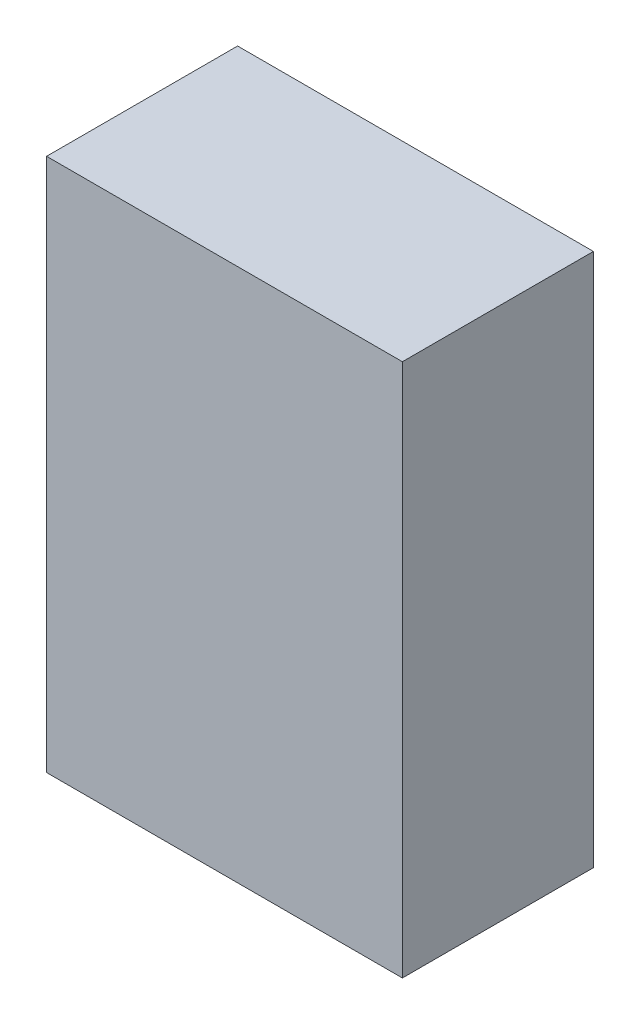
ISO-10303-21;
HEADER;
FILE_DESCRIPTION(('STEP AP214'),'2;1');
FILE_NAME('part.step','',(''),(''),'','','');
FILE_SCHEMA(('AUTOMOTIVE_DESIGN { 1 0 10303 214 1 1 1 1 }'));
ENDSEC;
DATA;
#1=APPLICATION_CONTEXT('core data for automotive mechanical design processes');
#2=APPLICATION_PROTOCOL_DEFINITION('international standard','automotive_design',2000,#1);
#3=PRODUCT_CONTEXT('',#1,'mechanical');
#4=PRODUCT('Part','Part','',(#3));
#5=PRODUCT_RELATED_PRODUCT_CATEGORY('part','',(#4));
#6=PRODUCT_DEFINITION_FORMATION('','',#4);
#7=PRODUCT_DEFINITION_CONTEXT('part definition',#1,'design');
#8=PRODUCT_DEFINITION('design','',#6,#7);
#9=PRODUCT_DEFINITION_SHAPE('','',#8);
#10=(LENGTH_UNIT() NAMED_UNIT(*) SI_UNIT(.MILLI.,.METRE.));
#11=(NAMED_UNIT(*) PLANE_ANGLE_UNIT() SI_UNIT($,.RADIAN.));
#12=(NAMED_UNIT(*) SI_UNIT($,.STERADIAN.) SOLID_ANGLE_UNIT());
#13=UNCERTAINTY_MEASURE_WITH_UNIT(LENGTH_MEASURE(1.E-05),#10,'distance_accuracy_value','');
#14=(GEOMETRIC_REPRESENTATION_CONTEXT(3) GLOBAL_UNCERTAINTY_ASSIGNED_CONTEXT((#13)) GLOBAL_UNIT_ASSIGNED_CONTEXT((#10,
#11,#12)) REPRESENTATION_CONTEXT('',''));
#15=CARTESIAN_POINT('',(0.,0.,0.));
#16=DIRECTION('',(0.,0.,1.));
#17=DIRECTION('',(1.,0.,0.));
#18=AXIS2_PLACEMENT_3D('',#15,#16,#17);
#19=CARTESIAN_POINT('',(0.,0.,0.2999994));
#20=DIRECTION('',(0.,0.,1.));
#21=DIRECTION('',(1.,0.,0.));
#22=AXIS2_PLACEMENT_3D('',#19,#20,#21);
#23=PLANE('',#22);
#24=DIRECTION('',(1.,0.,0.));
#25=VECTOR('',#24,1.);
#26=CARTESIAN_POINT('',(-0.2794,-0.4191,0.2999994));
#27=LINE('',#26,#25);
#28=CARTESIAN_POINT('',(-0.2794,-0.4191,0.2999994));
#29=VERTEX_POINT('',#28);
#30=CARTESIAN_POINT('',(0.2794,-0.4191,0.2999994));
#31=VERTEX_POINT('',#30);
#32=EDGE_CURVE('E82',#29,#31,#27,.T.);
#33=ORIENTED_EDGE('',*,*,#32,.T.);
#34=DIRECTION('',(0.,1.,0.));
#35=VECTOR('',#34,1.);
#36=CARTESIAN_POINT('',(0.2794,-0.4191,0.2999994));
#37=LINE('',#36,#35);
#38=CARTESIAN_POINT('',(0.2794,0.4191,0.2999994));
#39=VERTEX_POINT('',#38);
#40=EDGE_CURVE('E101',#31,#39,#37,.T.);
#41=ORIENTED_EDGE('',*,*,#40,.T.);
#42=DIRECTION('',(-1.,0.,0.));
#43=VECTOR('',#42,1.);
#44=CARTESIAN_POINT('',(0.2794,0.4191,0.2999994));
#45=LINE('',#44,#43);
#46=CARTESIAN_POINT('',(-0.2794,0.4191,0.2999994));
#47=VERTEX_POINT('',#46);
#48=EDGE_CURVE('E75',#39,#47,#45,.T.);
#49=ORIENTED_EDGE('',*,*,#48,.T.);
#50=DIRECTION('',(0.,-1.,0.));
#51=VECTOR('',#50,1.);
#52=CARTESIAN_POINT('',(-0.2794,0.4191,0.2999994));
#53=LINE('',#52,#51);
#54=EDGE_CURVE('E11',#47,#29,#53,.T.);
#55=ORIENTED_EDGE('',*,*,#54,.T.);
#56=EDGE_LOOP('',(#33,#41,#49,#55));
#57=FACE_BOUND('',#56,.T.);
#58=ADVANCED_FACE('F17',(#57),#23,.T.);
#59=CARTESIAN_POINT('',(0.,0.,0.));
#60=DIRECTION('',(0.,0.,1.));
#61=DIRECTION('',(1.,0.,0.));
#62=AXIS2_PLACEMENT_3D('',#59,#60,#61);
#63=PLANE('',#62);
#64=DIRECTION('',(0.,-1.,0.));
#65=VECTOR('',#64,1.);
#66=CARTESIAN_POINT('',(-0.2794,0.4191,0.));
#67=LINE('',#66,#65);
#68=CARTESIAN_POINT('',(-0.2794,0.4191,0.));
#69=VERTEX_POINT('',#68);
#70=CARTESIAN_POINT('',(-0.2794,-0.4191,0.));
#71=VERTEX_POINT('',#70);
#72=EDGE_CURVE('E26',#69,#71,#67,.T.);
#73=ORIENTED_EDGE('',*,*,#72,.F.);
#74=DIRECTION('',(-1.,0.,0.));
#75=VECTOR('',#74,1.);
#76=CARTESIAN_POINT('',(0.2794,0.4191,0.));
#77=LINE('',#76,#75);
#78=CARTESIAN_POINT('',(0.2794,0.4191,0.));
#79=VERTEX_POINT('',#78);
#80=EDGE_CURVE('E109',#79,#69,#77,.T.);
#81=ORIENTED_EDGE('',*,*,#80,.F.);
#82=DIRECTION('',(0.,1.,0.));
#83=VECTOR('',#82,1.);
#84=CARTESIAN_POINT('',(0.2794,-0.4191,0.));
#85=LINE('',#84,#83);
#86=CARTESIAN_POINT('',(0.2794,-0.4191,0.));
#87=VERTEX_POINT('',#86);
#88=EDGE_CURVE('E84',#87,#79,#85,.T.);
#89=ORIENTED_EDGE('',*,*,#88,.F.);
#90=DIRECTION('',(1.,0.,0.));
#91=VECTOR('',#90,1.);
#92=CARTESIAN_POINT('',(-0.2794,-0.4191,0.));
#93=LINE('',#92,#91);
#94=EDGE_CURVE('E80',#71,#87,#93,.T.);
#95=ORIENTED_EDGE('',*,*,#94,.F.);
#96=EDGE_LOOP('',(#73,#81,#89,#95));
#97=FACE_BOUND('',#96,.T.);
#98=ADVANCED_FACE('F19',(#97),#63,.F.);
#99=CARTESIAN_POINT('',(-0.2794,0.4191,0.));
#100=DIRECTION('',(1.,0.,0.));
#101=DIRECTION('',(0.,1.,0.));
#102=AXIS2_PLACEMENT_3D('',#99,#100,#101);
#103=PLANE('',#102);
#104=ORIENTED_EDGE('',*,*,#72,.T.);
#105=DIRECTION('',(0.,0.,1.));
#106=VECTOR('',#105,1.);
#107=CARTESIAN_POINT('',(-0.2794,-0.4191,0.));
#108=LINE('',#107,#106);
#109=EDGE_CURVE('E69',#71,#29,#108,.T.);
#110=ORIENTED_EDGE('',*,*,#109,.T.);
#111=ORIENTED_EDGE('',*,*,#54,.F.);
#112=DIRECTION('',(0.,0.,1.));
#113=VECTOR('',#112,1.);
#114=CARTESIAN_POINT('',(-0.2794,0.4191,0.));
#115=LINE('',#114,#113);
#116=EDGE_CURVE('E72',#69,#47,#115,.T.);
#117=ORIENTED_EDGE('',*,*,#116,.F.);
#118=EDGE_LOOP('',(#104,#110,#111,#117));
#119=FACE_BOUND('',#118,.T.);
#120=ADVANCED_FACE('F68',(#119),#103,.F.);
#121=CARTESIAN_POINT('',(0.2794,0.4191,0.));
#122=DIRECTION('',(0.,-1.,0.));
#123=DIRECTION('',(0.,0.,-1.));
#124=AXIS2_PLACEMENT_3D('',#121,#122,#123);
#125=PLANE('',#124);
#126=ORIENTED_EDGE('',*,*,#80,.T.);
#127=ORIENTED_EDGE('',*,*,#116,.T.);
#128=ORIENTED_EDGE('',*,*,#48,.F.);
#129=DIRECTION('',(0.,0.,1.));
#130=VECTOR('',#129,1.);
#131=CARTESIAN_POINT('',(0.2794,0.4191,0.));
#132=LINE('',#131,#130);
#133=EDGE_CURVE('E97',#79,#39,#132,.T.);
#134=ORIENTED_EDGE('',*,*,#133,.F.);
#135=EDGE_LOOP('',(#126,#127,#128,#134));
#136=FACE_BOUND('',#135,.T.);
#137=ADVANCED_FACE('F120',(#136),#125,.F.);
#138=CARTESIAN_POINT('',(0.2794,-0.4191,0.));
#139=DIRECTION('',(-1.,0.,0.));
#140=DIRECTION('',(0.,0.,1.));
#141=AXIS2_PLACEMENT_3D('',#138,#139,#140);
#142=PLANE('',#141);
#143=ORIENTED_EDGE('',*,*,#88,.T.);
#144=ORIENTED_EDGE('',*,*,#133,.T.);
#145=ORIENTED_EDGE('',*,*,#40,.F.);
#146=DIRECTION('',(0.,0.,1.));
#147=VECTOR('',#146,1.);
#148=CARTESIAN_POINT('',(0.2794,-0.4191,0.));
#149=LINE('',#148,#147);
#150=EDGE_CURVE('E89',#87,#31,#149,.T.);
#151=ORIENTED_EDGE('',*,*,#150,.F.);
#152=EDGE_LOOP('',(#143,#144,#145,#151));
#153=FACE_BOUND('',#152,.T.);
#154=ADVANCED_FACE('F122',(#153),#142,.F.);
#155=CARTESIAN_POINT('',(-0.2794,-0.4191,0.));
#156=DIRECTION('',(0.,1.,0.));
#157=DIRECTION('',(1.,0.,0.));
#158=AXIS2_PLACEMENT_3D('',#155,#156,#157);
#159=PLANE('',#158);
#160=ORIENTED_EDGE('',*,*,#94,.T.);
#161=ORIENTED_EDGE('',*,*,#150,.T.);
#162=ORIENTED_EDGE('',*,*,#32,.F.);
#163=ORIENTED_EDGE('',*,*,#109,.F.);
#164=EDGE_LOOP('',(#160,#161,#162,#163));
#165=FACE_BOUND('',#164,.T.);
#166=ADVANCED_FACE('F78',(#165),#159,.F.);
#167=CLOSED_SHELL('',(#58,#98,#120,#137,#154,#166));
#168=MANIFOLD_SOLID_BREP('B1',#167);
#169=ADVANCED_BREP_SHAPE_REPRESENTATION('',(#18,#168),#14);
#170=SHAPE_DEFINITION_REPRESENTATION(#9,#169);
ENDSEC;
END-ISO-10303-21;
